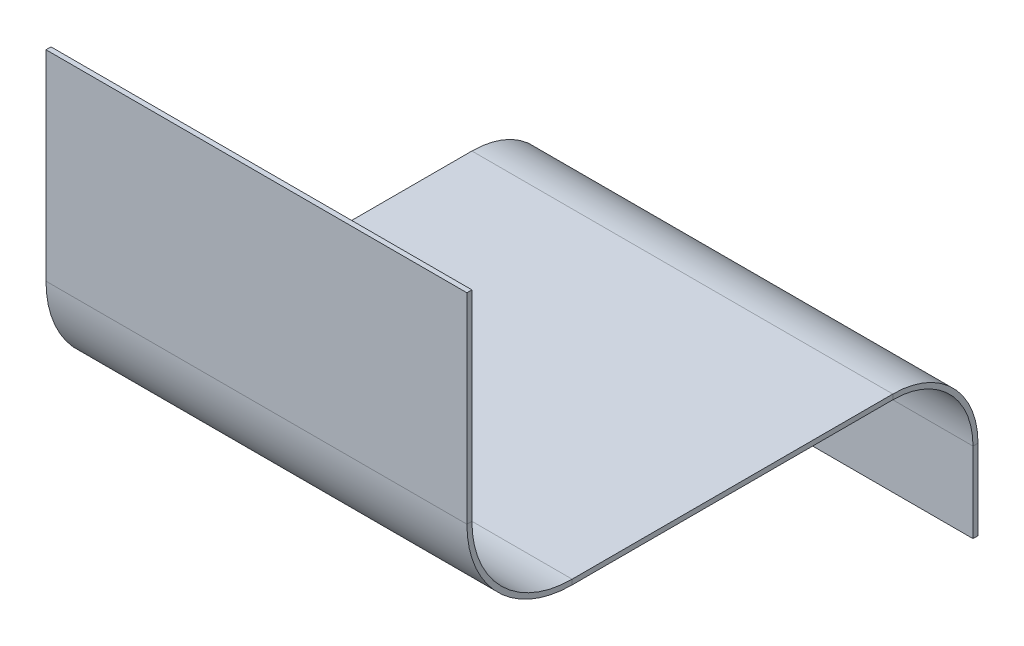
ISO-10303-21;
HEADER;
FILE_DESCRIPTION(('STEP AP214'),'2;1');
FILE_NAME('part.step','',(''),(''),'','','');
FILE_SCHEMA(('AUTOMOTIVE_DESIGN { 1 0 10303 214 1 1 1 1 }'));
ENDSEC;
DATA;
#1=APPLICATION_CONTEXT('core data for automotive mechanical design processes');
#2=APPLICATION_PROTOCOL_DEFINITION('international standard','automotive_design',2000,#1);
#3=PRODUCT_CONTEXT('',#1,'mechanical');
#4=PRODUCT('Part','Part','',(#3));
#5=PRODUCT_RELATED_PRODUCT_CATEGORY('part','',(#4));
#6=PRODUCT_DEFINITION_FORMATION('','',#4);
#7=PRODUCT_DEFINITION_CONTEXT('part definition',#1,'design');
#8=PRODUCT_DEFINITION('design','',#6,#7);
#9=PRODUCT_DEFINITION_SHAPE('','',#8);
#10=(LENGTH_UNIT() NAMED_UNIT(*) SI_UNIT(.MILLI.,.METRE.));
#11=(NAMED_UNIT(*) PLANE_ANGLE_UNIT() SI_UNIT($,.RADIAN.));
#12=(NAMED_UNIT(*) SI_UNIT($,.STERADIAN.) SOLID_ANGLE_UNIT());
#13=UNCERTAINTY_MEASURE_WITH_UNIT(LENGTH_MEASURE(1.E-05),#10,'distance_accuracy_value','');
#14=(GEOMETRIC_REPRESENTATION_CONTEXT(3) GLOBAL_UNCERTAINTY_ASSIGNED_CONTEXT((#13)) GLOBAL_UNIT_ASSIGNED_CONTEXT((#10,
#11,#12)) REPRESENTATION_CONTEXT('',''));
#15=CARTESIAN_POINT('',(0.,0.,0.));
#16=DIRECTION('',(0.,0.,1.));
#17=DIRECTION('',(1.,0.,0.));
#18=AXIS2_PLACEMENT_3D('',#15,#16,#17);
#19=CARTESIAN_POINT('',(21.,8.25,0.));
#20=DIRECTION('',(-1.,0.,0.));
#21=DIRECTION('',(0.,0.,1.));
#22=AXIS2_PLACEMENT_3D('',#19,#20,#21);
#23=PLANE('',#22);
#24=DIRECTION('',(0.,-1.,0.));
#25=VECTOR('',#24,1.);
#26=CARTESIAN_POINT('',(21.,8.25000000000007,20.));
#27=LINE('',#26,#25);
#28=CARTESIAN_POINT('',(21.,8.25000000000007,20.));
#29=VERTEX_POINT('',#28);
#30=CARTESIAN_POINT('',(21.,8.00000000000007,20.));
#31=VERTEX_POINT('',#30);
#32=EDGE_CURVE('E176',#29,#31,#27,.T.);
#33=ORIENTED_EDGE('',*,*,#32,.T.);
#34=DIRECTION('',(0.,0.,-1.));
#35=VECTOR('',#34,1.);
#36=CARTESIAN_POINT('',(21.,8.,0.));
#37=LINE('',#36,#35);
#38=CARTESIAN_POINT('',(21.,8.00000000000001,3.99999999999999));
#39=VERTEX_POINT('',#38);
#40=EDGE_CURVE('E196',#31,#39,#37,.T.);
#41=ORIENTED_EDGE('',*,*,#40,.T.);
#42=DIRECTION('',(0.,1.,0.));
#43=VECTOR('',#42,1.);
#44=CARTESIAN_POINT('',(21.,8.00000000000001,3.99999999999999));
#45=LINE('',#44,#43);
#46=CARTESIAN_POINT('',(21.,8.25000000000001,3.99999999999999));
#47=VERTEX_POINT('',#46);
#48=EDGE_CURVE('E185',#39,#47,#45,.T.);
#49=ORIENTED_EDGE('',*,*,#48,.T.);
#50=DIRECTION('',(0.,0.,-1.));
#51=VECTOR('',#50,1.);
#52=CARTESIAN_POINT('',(21.,8.25,0.));
#53=LINE('',#52,#51);
#54=EDGE_CURVE('E197',#29,#47,#53,.T.);
#55=ORIENTED_EDGE('',*,*,#54,.F.);
#56=EDGE_LOOP('',(#33,#41,#49,#55));
#57=FACE_BOUND('',#56,.T.);
#58=ADVANCED_FACE('F38',(#57),#23,.F.);
#59=CARTESIAN_POINT('',(0.,8.25000000000009,25.));
#60=DIRECTION('',(1.,0.,0.));
#61=DIRECTION('',(0.,0.,-1.));
#62=AXIS2_PLACEMENT_3D('',#59,#60,#61);
#63=PLANE('',#62);
#64=DIRECTION('',(0.,-1.,0.));
#65=VECTOR('',#64,1.);
#66=CARTESIAN_POINT('',(0.,8.25000000000007,20.));
#67=LINE('',#66,#65);
#68=CARTESIAN_POINT('',(0.,8.25000000000007,20.));
#69=VERTEX_POINT('',#68);
#70=CARTESIAN_POINT('',(0.,8.00000000000007,20.));
#71=VERTEX_POINT('',#70);
#72=EDGE_CURVE('E183',#69,#71,#67,.T.);
#73=ORIENTED_EDGE('',*,*,#72,.F.);
#74=DIRECTION('',(0.,0.,1.));
#75=VECTOR('',#74,1.);
#76=CARTESIAN_POINT('',(0.,8.25000000000009,25.));
#77=LINE('',#76,#75);
#78=CARTESIAN_POINT('',(0.,8.25000000000001,3.99999999999999));
#79=VERTEX_POINT('',#78);
#80=EDGE_CURVE('E199',#79,#69,#77,.T.);
#81=ORIENTED_EDGE('',*,*,#80,.F.);
#82=DIRECTION('',(0.,1.,0.));
#83=VECTOR('',#82,1.);
#84=CARTESIAN_POINT('',(0.,8.00000000000001,3.99999999999999));
#85=LINE('',#84,#83);
#86=CARTESIAN_POINT('',(0.,8.00000000000001,3.99999999999999));
#87=VERTEX_POINT('',#86);
#88=EDGE_CURVE('E189',#87,#79,#85,.T.);
#89=ORIENTED_EDGE('',*,*,#88,.F.);
#90=DIRECTION('',(0.,0.,1.));
#91=VECTOR('',#90,1.);
#92=CARTESIAN_POINT('',(0.,8.00000000000009,25.));
#93=LINE('',#92,#91);
#94=EDGE_CURVE('E200',#87,#71,#93,.T.);
#95=ORIENTED_EDGE('',*,*,#94,.T.);
#96=EDGE_LOOP('',(#73,#81,#89,#95));
#97=FACE_BOUND('',#96,.T.);
#98=ADVANCED_FACE('F278',(#97),#63,.F.);
#99=CARTESIAN_POINT('',(0.,8.25,0.));
#100=DIRECTION('',(0.,-1.,0.));
#101=DIRECTION('',(0.,0.,-1.));
#102=AXIS2_PLACEMENT_3D('',#99,#100,#101);
#103=PLANE('',#102);
#104=DIRECTION('',(1.,0.,0.));
#105=VECTOR('',#104,1.);
#106=CARTESIAN_POINT('',(21.,8.25000000000007,20.));
#107=LINE('',#106,#105);
#108=EDGE_CURVE('E180',#29,#69,#107,.F.);
#109=ORIENTED_EDGE('',*,*,#108,.F.);
#110=ORIENTED_EDGE('',*,*,#54,.T.);
#111=DIRECTION('',(1.,0.,0.));
#112=VECTOR('',#111,1.);
#113=CARTESIAN_POINT('',(0.,8.25000000000001,3.99999999999999));
#114=LINE('',#113,#112);
#115=EDGE_CURVE('E192',#79,#47,#114,.T.);
#116=ORIENTED_EDGE('',*,*,#115,.F.);
#117=ORIENTED_EDGE('',*,*,#80,.T.);
#118=EDGE_LOOP('',(#109,#110,#116,#117));
#119=FACE_BOUND('',#118,.T.);
#120=ADVANCED_FACE('F284',(#119),#103,.F.);
#121=CARTESIAN_POINT('',(0.,8.,0.));
#122=DIRECTION('',(0.,-1.,0.));
#123=DIRECTION('',(0.,0.,-1.));
#124=AXIS2_PLACEMENT_3D('',#121,#122,#123);
#125=PLANE('',#124);
#126=ORIENTED_EDGE('',*,*,#40,.F.);
#127=DIRECTION('',(1.,0.,0.));
#128=VECTOR('',#127,1.);
#129=CARTESIAN_POINT('',(21.,8.00000000000007,20.));
#130=LINE('',#129,#128);
#131=EDGE_CURVE('E131',#31,#71,#130,.F.);
#132=ORIENTED_EDGE('',*,*,#131,.T.);
#133=ORIENTED_EDGE('',*,*,#94,.F.);
#134=DIRECTION('',(-1.,0.,0.));
#135=VECTOR('',#134,1.);
#136=CARTESIAN_POINT('',(21.,8.00000000000001,3.99999999999999));
#137=LINE('',#136,#135);
#138=EDGE_CURVE('E187',#39,#87,#137,.T.);
#139=ORIENTED_EDGE('',*,*,#138,.F.);
#140=EDGE_LOOP('',(#126,#132,#133,#139));
#141=FACE_BOUND('',#140,.T.);
#142=ADVANCED_FACE('F363',(#141),#125,.T.);
#143=CARTESIAN_POINT('',(0.,0.,-0.25));
#144=DIRECTION('',(-1.,0.,0.));
#145=DIRECTION('',(0.,-1.,0.));
#146=AXIS2_PLACEMENT_3D('',#143,#144,#145);
#147=PLANE('',#146);
#148=DIRECTION('',(0.,-1.,0.));
#149=VECTOR('',#148,1.);
#150=CARTESIAN_POINT('',(0.,0.,0.));
#151=LINE('',#150,#149);
#152=CARTESIAN_POINT('',(0.,4.00000000000001,0.));
#153=VERTEX_POINT('',#152);
#154=CARTESIAN_POINT('',(0.,0.,0.));
#155=VERTEX_POINT('',#154);
#156=EDGE_CURVE('E224',#153,#155,#151,.T.);
#157=ORIENTED_EDGE('',*,*,#156,.F.);
#158=DIRECTION('',(0.,0.,-1.));
#159=VECTOR('',#158,1.);
#160=CARTESIAN_POINT('',(0.,4.00000000000001,0.));
#161=LINE('',#160,#159);
#162=CARTESIAN_POINT('',(0.,4.00000000000001,-0.25));
#163=VERTEX_POINT('',#162);
#164=EDGE_CURVE('E212',#153,#163,#161,.T.);
#165=ORIENTED_EDGE('',*,*,#164,.T.);
#166=DIRECTION('',(0.,-1.,0.));
#167=VECTOR('',#166,1.);
#168=CARTESIAN_POINT('',(0.,0.,-0.25));
#169=LINE('',#168,#167);
#170=CARTESIAN_POINT('',(0.,0.,-0.25));
#171=VERTEX_POINT('',#170);
#172=EDGE_CURVE('E227',#163,#171,#169,.T.);
#173=ORIENTED_EDGE('',*,*,#172,.T.);
#174=DIRECTION('',(0.,0.,1.));
#175=VECTOR('',#174,1.);
#176=CARTESIAN_POINT('',(0.,0.,-0.25));
#177=LINE('',#176,#175);
#178=EDGE_CURVE('E42',#171,#155,#177,.T.);
#179=ORIENTED_EDGE('',*,*,#178,.T.);
#180=EDGE_LOOP('',(#157,#165,#173,#179));
#181=FACE_BOUND('',#180,.T.);
#182=ADVANCED_FACE('F40',(#181),#147,.T.);
#183=CARTESIAN_POINT('',(0.,0.,-0.25));
#184=DIRECTION('',(0.,0.,-1.));
#185=DIRECTION('',(-1.,0.,0.));
#186=AXIS2_PLACEMENT_3D('',#183,#184,#185);
#187=PLANE('',#186);
#188=ORIENTED_EDGE('',*,*,#172,.F.);
#189=DIRECTION('',(-1.,0.,0.));
#190=VECTOR('',#189,1.);
#191=CARTESIAN_POINT('',(0.,4.00000000000001,-0.25));
#192=LINE('',#191,#190);
#193=CARTESIAN_POINT('',(21.,4.00000000000001,-0.25));
#194=VERTEX_POINT('',#193);
#195=EDGE_CURVE('E207',#163,#194,#192,.F.);
#196=ORIENTED_EDGE('',*,*,#195,.T.);
#197=DIRECTION('',(0.,1.,0.));
#198=VECTOR('',#197,1.);
#199=CARTESIAN_POINT('',(21.,0.,-0.25));
#200=LINE('',#199,#198);
#201=CARTESIAN_POINT('',(21.,0.,-0.25));
#202=VERTEX_POINT('',#201);
#203=EDGE_CURVE('E233',#202,#194,#200,.T.);
#204=ORIENTED_EDGE('',*,*,#203,.F.);
#205=DIRECTION('',(1.,0.,0.));
#206=VECTOR('',#205,1.);
#207=CARTESIAN_POINT('',(0.,0.,-0.25));
#208=LINE('',#207,#206);
#209=EDGE_CURVE('E229',#171,#202,#208,.T.);
#210=ORIENTED_EDGE('',*,*,#209,.F.);
#211=EDGE_LOOP('',(#188,#196,#204,#210));
#212=FACE_BOUND('',#211,.T.);
#213=ADVANCED_FACE('F257',(#212),#187,.T.);
#214=CARTESIAN_POINT('',(0.,0.,0.));
#215=DIRECTION('',(0.,0.,-1.));
#216=DIRECTION('',(-1.,0.,0.));
#217=AXIS2_PLACEMENT_3D('',#214,#215,#216);
#218=PLANE('',#217);
#219=DIRECTION('',(-1.,0.,0.));
#220=VECTOR('',#219,1.);
#221=CARTESIAN_POINT('',(0.,4.00000000000001,0.));
#222=LINE('',#221,#220);
#223=CARTESIAN_POINT('',(21.,4.00000000000001,0.));
#224=VERTEX_POINT('',#223);
#225=EDGE_CURVE('E218',#153,#224,#222,.F.);
#226=ORIENTED_EDGE('',*,*,#225,.F.);
#227=ORIENTED_EDGE('',*,*,#156,.T.);
#228=DIRECTION('',(1.,0.,0.));
#229=VECTOR('',#228,1.);
#230=CARTESIAN_POINT('',(0.,0.,0.));
#231=LINE('',#230,#229);
#232=CARTESIAN_POINT('',(21.,0.,0.));
#233=VERTEX_POINT('',#232);
#234=EDGE_CURVE('E237',#155,#233,#231,.T.);
#235=ORIENTED_EDGE('',*,*,#234,.T.);
#236=DIRECTION('',(0.,1.,0.));
#237=VECTOR('',#236,1.);
#238=CARTESIAN_POINT('',(21.,0.,0.));
#239=LINE('',#238,#237);
#240=EDGE_CURVE('E230',#233,#224,#239,.T.);
#241=ORIENTED_EDGE('',*,*,#240,.T.);
#242=EDGE_LOOP('',(#226,#227,#235,#241));
#243=FACE_BOUND('',#242,.T.);
#244=ADVANCED_FACE('F245',(#243),#218,.F.);
#245=CARTESIAN_POINT('',(21.,0.,-0.25));
#246=DIRECTION('',(1.,0.,0.));
#247=DIRECTION('',(0.,1.,0.));
#248=AXIS2_PLACEMENT_3D('',#245,#246,#247);
#249=PLANE('',#248);
#250=DIRECTION('',(0.,0.,-1.));
#251=VECTOR('',#250,1.);
#252=CARTESIAN_POINT('',(21.,4.00000000000001,0.));
#253=LINE('',#252,#251);
#254=EDGE_CURVE('E222',#224,#194,#253,.T.);
#255=ORIENTED_EDGE('',*,*,#254,.F.);
#256=ORIENTED_EDGE('',*,*,#240,.F.);
#257=DIRECTION('',(0.,0.,1.));
#258=VECTOR('',#257,1.);
#259=CARTESIAN_POINT('',(21.,0.,-0.25));
#260=LINE('',#259,#258);
#261=EDGE_CURVE('E11',#202,#233,#260,.T.);
#262=ORIENTED_EDGE('',*,*,#261,.F.);
#263=ORIENTED_EDGE('',*,*,#203,.T.);
#264=EDGE_LOOP('',(#255,#256,#262,#263));
#265=FACE_BOUND('',#264,.T.);
#266=ADVANCED_FACE('F249',(#265),#249,.T.);
#267=CARTESIAN_POINT('',(0.,0.,-0.25));
#268=DIRECTION('',(0.,-1.,0.));
#269=DIRECTION('',(0.,0.,-1.));
#270=AXIS2_PLACEMENT_3D('',#267,#268,#269);
#271=PLANE('',#270);
#272=ORIENTED_EDGE('',*,*,#234,.F.);
#273=ORIENTED_EDGE('',*,*,#178,.F.);
#274=ORIENTED_EDGE('',*,*,#209,.T.);
#275=ORIENTED_EDGE('',*,*,#261,.T.);
#276=EDGE_LOOP('',(#272,#273,#274,#275));
#277=FACE_BOUND('',#276,.T.);
#278=ADVANCED_FACE('F269',(#277),#271,.T.);
#279=CARTESIAN_POINT('',(21.,4.00000000000001,4.));
#280=DIRECTION('',(1.,0.,0.));
#281=DIRECTION('',(0.,0.,-1.));
#282=AXIS2_PLACEMENT_3D('',#279,#280,#281);
#283=PLANE('',#282);
#284=ORIENTED_EDGE('',*,*,#48,.F.);
#285=CARTESIAN_POINT('',(21.,4.00000000000001,4.));
#286=DIRECTION('',(-1.,0.,0.));
#287=DIRECTION('',(0.,0.,1.));
#288=AXIS2_PLACEMENT_3D('',#285,#286,#287);
#289=CIRCLE('',#288,4.);
#290=EDGE_CURVE('E215',#224,#39,#289,.F.);
#291=ORIENTED_EDGE('',*,*,#290,.F.);
#292=ORIENTED_EDGE('',*,*,#254,.T.);
#293=CARTESIAN_POINT('',(21.,4.00000000000001,4.));
#294=DIRECTION('',(-1.,0.,0.));
#295=DIRECTION('',(0.,0.,1.));
#296=AXIS2_PLACEMENT_3D('',#293,#294,#295);
#297=CIRCLE('',#296,4.25);
#298=EDGE_CURVE('E61',#194,#47,#297,.F.);
#299=ORIENTED_EDGE('',*,*,#298,.T.);
#300=EDGE_LOOP('',(#284,#291,#292,#299));
#301=FACE_BOUND('',#300,.T.);
#302=ADVANCED_FACE('F254',(#301),#283,.T.);
#303=CARTESIAN_POINT('',(0.,4.00000000000001,4.));
#304=DIRECTION('',(1.,0.,0.));
#305=DIRECTION('',(0.,0.,-1.));
#306=AXIS2_PLACEMENT_3D('',#303,#304,#305);
#307=PLANE('',#306);
#308=CARTESIAN_POINT('',(0.,4.00000000000001,4.));
#309=DIRECTION('',(-1.,0.,0.));
#310=DIRECTION('',(0.,0.,1.));
#311=AXIS2_PLACEMENT_3D('',#308,#309,#310);
#312=CIRCLE('',#311,4.);
#313=EDGE_CURVE('E203',#87,#153,#312,.T.);
#314=ORIENTED_EDGE('',*,*,#313,.F.);
#315=ORIENTED_EDGE('',*,*,#88,.T.);
#316=CARTESIAN_POINT('',(0.,4.00000000000001,4.));
#317=DIRECTION('',(-1.,0.,0.));
#318=DIRECTION('',(0.,0.,1.));
#319=AXIS2_PLACEMENT_3D('',#316,#317,#318);
#320=CIRCLE('',#319,4.25);
#321=EDGE_CURVE('E210',#79,#163,#320,.T.);
#322=ORIENTED_EDGE('',*,*,#321,.T.);
#323=ORIENTED_EDGE('',*,*,#164,.F.);
#324=EDGE_LOOP('',(#314,#315,#322,#323));
#325=FACE_BOUND('',#324,.T.);
#326=ADVANCED_FACE('F262',(#325),#307,.F.);
#327=CARTESIAN_POINT('',(0.,4.00000000000001,4.));
#328=DIRECTION('',(-1.,0.,0.));
#329=DIRECTION('',(0.,1.,0.));
#330=AXIS2_PLACEMENT_3D('',#327,#328,#329);
#331=CYLINDRICAL_SURFACE('',#330,4.25);
#332=ORIENTED_EDGE('',*,*,#195,.F.);
#333=ORIENTED_EDGE('',*,*,#321,.F.);
#334=ORIENTED_EDGE('',*,*,#115,.T.);
#335=ORIENTED_EDGE('',*,*,#298,.F.);
#336=EDGE_LOOP('',(#332,#333,#334,#335));
#337=FACE_BOUND('',#336,.T.);
#338=ADVANCED_FACE('F259',(#337),#331,.T.);
#339=CARTESIAN_POINT('',(0.,4.00000000000001,4.));
#340=DIRECTION('',(-1.,0.,0.));
#341=DIRECTION('',(0.,1.,0.));
#342=AXIS2_PLACEMENT_3D('',#339,#340,#341);
#343=CYLINDRICAL_SURFACE('',#342,4.);
#344=ORIENTED_EDGE('',*,*,#225,.T.);
#345=ORIENTED_EDGE('',*,*,#290,.T.);
#346=ORIENTED_EDGE('',*,*,#138,.T.);
#347=ORIENTED_EDGE('',*,*,#313,.T.);
#348=EDGE_LOOP('',(#344,#345,#346,#347));
#349=FACE_BOUND('',#348,.T.);
#350=ADVANCED_FACE('F291',(#349),#343,.F.);
#351=CARTESIAN_POINT('',(0.,13.2500000000001,20.));
#352=DIRECTION('',(-1.,0.,0.));
#353=DIRECTION('',(0.,0.,1.));
#354=AXIS2_PLACEMENT_3D('',#351,#352,#353);
#355=PLANE('',#354);
#356=DIRECTION('',(0.,0.,1.));
#357=VECTOR('',#356,1.);
#358=CARTESIAN_POINT('',(0.,13.2500000000001,25.));
#359=LINE('',#358,#357);
#360=CARTESIAN_POINT('',(0.,13.2500000000001,25.));
#361=VERTEX_POINT('',#360);
#362=CARTESIAN_POINT('',(0.,13.2500000000001,25.25));
#363=VERTEX_POINT('',#362);
#364=EDGE_CURVE('E477',#361,#363,#359,.T.);
#365=ORIENTED_EDGE('',*,*,#364,.F.);
#366=CARTESIAN_POINT('',(0.,13.2500000000001,20.));
#367=DIRECTION('',(1.,0.,0.));
#368=DIRECTION('',(0.,0.,-1.));
#369=AXIS2_PLACEMENT_3D('',#366,#367,#368);
#370=CIRCLE('',#369,5.);
#371=EDGE_CURVE('E134',#69,#361,#370,.F.);
#372=ORIENTED_EDGE('',*,*,#371,.F.);
#373=ORIENTED_EDGE('',*,*,#72,.T.);
#374=CARTESIAN_POINT('',(0.,13.2500000000001,20.));
#375=DIRECTION('',(1.,0.,0.));
#376=DIRECTION('',(0.,0.,-1.));
#377=AXIS2_PLACEMENT_3D('',#374,#375,#376);
#378=CIRCLE('',#377,5.25);
#379=EDGE_CURVE('E53',#71,#363,#378,.F.);
#380=ORIENTED_EDGE('',*,*,#379,.T.);
#381=EDGE_LOOP('',(#365,#372,#373,#380));
#382=FACE_BOUND('',#381,.T.);
#383=ADVANCED_FACE('F293',(#382),#355,.T.);
#384=CARTESIAN_POINT('',(21.,13.2500000000001,20.));
#385=DIRECTION('',(-1.,0.,0.));
#386=DIRECTION('',(0.,0.,1.));
#387=AXIS2_PLACEMENT_3D('',#384,#385,#386);
#388=PLANE('',#387);
#389=CARTESIAN_POINT('',(21.,13.2500000000001,20.));
#390=DIRECTION('',(1.,0.,0.));
#391=DIRECTION('',(0.,0.,-1.));
#392=AXIS2_PLACEMENT_3D('',#389,#390,#391);
#393=CIRCLE('',#392,5.);
#394=CARTESIAN_POINT('',(21.,13.2500000000001,25.));
#395=VERTEX_POINT('',#394);
#396=EDGE_CURVE('E141',#395,#29,#393,.T.);
#397=ORIENTED_EDGE('',*,*,#396,.F.);
#398=DIRECTION('',(0.,0.,1.));
#399=VECTOR('',#398,1.);
#400=CARTESIAN_POINT('',(21.,13.2500000000001,25.));
#401=LINE('',#400,#399);
#402=CARTESIAN_POINT('',(21.,13.2500000000001,25.25));
#403=VERTEX_POINT('',#402);
#404=EDGE_CURVE('E138',#395,#403,#401,.T.);
#405=ORIENTED_EDGE('',*,*,#404,.T.);
#406=CARTESIAN_POINT('',(21.,13.2500000000001,20.));
#407=DIRECTION('',(1.,0.,0.));
#408=DIRECTION('',(0.,0.,-1.));
#409=AXIS2_PLACEMENT_3D('',#406,#407,#408);
#410=CIRCLE('',#409,5.25);
#411=EDGE_CURVE('E125',#403,#31,#410,.T.);
#412=ORIENTED_EDGE('',*,*,#411,.T.);
#413=ORIENTED_EDGE('',*,*,#32,.F.);
#414=EDGE_LOOP('',(#397,#405,#412,#413));
#415=FACE_BOUND('',#414,.T.);
#416=ADVANCED_FACE('F139',(#415),#388,.F.);
#417=CARTESIAN_POINT('',(21.,13.2500000000001,20.));
#418=DIRECTION('',(1.,0.,0.));
#419=DIRECTION('',(0.,0.,1.));
#420=AXIS2_PLACEMENT_3D('',#417,#418,#419);
#421=CYLINDRICAL_SURFACE('',#420,5.25);
#422=ORIENTED_EDGE('',*,*,#131,.F.);
#423=ORIENTED_EDGE('',*,*,#411,.F.);
#424=DIRECTION('',(-1.,0.,0.));
#425=VECTOR('',#424,1.);
#426=CARTESIAN_POINT('',(0.,13.2500000000001,25.25));
#427=LINE('',#426,#425);
#428=EDGE_CURVE('E129',#403,#363,#427,.T.);
#429=ORIENTED_EDGE('',*,*,#428,.T.);
#430=ORIENTED_EDGE('',*,*,#379,.F.);
#431=EDGE_LOOP('',(#422,#423,#429,#430));
#432=FACE_BOUND('',#431,.T.);
#433=ADVANCED_FACE('F127',(#432),#421,.T.);
#434=CARTESIAN_POINT('',(21.,13.2500000000001,20.));
#435=DIRECTION('',(1.,0.,0.));
#436=DIRECTION('',(0.,0.,1.));
#437=AXIS2_PLACEMENT_3D('',#434,#435,#436);
#438=CYLINDRICAL_SURFACE('',#437,5.);
#439=ORIENTED_EDGE('',*,*,#108,.T.);
#440=ORIENTED_EDGE('',*,*,#371,.T.);
#441=DIRECTION('',(1.,0.,0.));
#442=VECTOR('',#441,1.);
#443=CARTESIAN_POINT('',(0.,13.2500000000001,25.));
#444=LINE('',#443,#442);
#445=EDGE_CURVE('E145',#361,#395,#444,.T.);
#446=ORIENTED_EDGE('',*,*,#445,.T.);
#447=ORIENTED_EDGE('',*,*,#396,.T.);
#448=EDGE_LOOP('',(#439,#440,#446,#447));
#449=FACE_BOUND('',#448,.T.);
#450=ADVANCED_FACE('F397',(#449),#438,.F.);
#451=CARTESIAN_POINT('',(0.,8.25000000000009,25.25));
#452=DIRECTION('',(1.,0.,0.));
#453=DIRECTION('',(0.,0.,-1.));
#454=AXIS2_PLACEMENT_3D('',#451,#452,#453);
#455=PLANE('',#454);
#456=ORIENTED_EDGE('',*,*,#364,.T.);
#457=DIRECTION('',(0.,-1.,0.));
#458=VECTOR('',#457,1.);
#459=CARTESIAN_POINT('',(0.,8.25000000000009,25.25));
#460=LINE('',#459,#458);
#461=CARTESIAN_POINT('',(0.,23.2500000000001,25.25));
#462=VERTEX_POINT('',#461);
#463=EDGE_CURVE('E153',#462,#363,#460,.T.);
#464=ORIENTED_EDGE('',*,*,#463,.F.);
#465=DIRECTION('',(0.,0.,-1.));
#466=VECTOR('',#465,1.);
#467=CARTESIAN_POINT('',(0.,23.2500000000001,25.25));
#468=LINE('',#467,#466);
#469=CARTESIAN_POINT('',(0.,23.2500000000001,25.));
#470=VERTEX_POINT('',#469);
#471=EDGE_CURVE('E162',#462,#470,#468,.T.);
#472=ORIENTED_EDGE('',*,*,#471,.T.);
#473=DIRECTION('',(0.,-1.,0.));
#474=VECTOR('',#473,1.);
#475=CARTESIAN_POINT('',(0.,8.25000000000009,25.));
#476=LINE('',#475,#474);
#477=EDGE_CURVE('E154',#470,#361,#476,.T.);
#478=ORIENTED_EDGE('',*,*,#477,.T.);
#479=EDGE_LOOP('',(#456,#464,#472,#478));
#480=FACE_BOUND('',#479,.T.);
#481=ADVANCED_FACE('F407',(#480),#455,.F.);
#482=CARTESIAN_POINT('',(21.,23.2500000000001,25.25));
#483=DIRECTION('',(-1.,0.,0.));
#484=DIRECTION('',(0.,0.,1.));
#485=AXIS2_PLACEMENT_3D('',#482,#483,#484);
#486=PLANE('',#485);
#487=ORIENTED_EDGE('',*,*,#404,.F.);
#488=DIRECTION('',(0.,1.,0.));
#489=VECTOR('',#488,1.);
#490=CARTESIAN_POINT('',(21.,23.2500000000001,25.));
#491=LINE('',#490,#489);
#492=CARTESIAN_POINT('',(21.,23.2500000000001,25.));
#493=VERTEX_POINT('',#492);
#494=EDGE_CURVE('E169',#395,#493,#491,.T.);
#495=ORIENTED_EDGE('',*,*,#494,.T.);
#496=DIRECTION('',(0.,0.,-1.));
#497=VECTOR('',#496,1.);
#498=CARTESIAN_POINT('',(21.,23.2500000000001,25.25));
#499=LINE('',#498,#497);
#500=CARTESIAN_POINT('',(21.,23.2500000000001,25.25));
#501=VERTEX_POINT('',#500);
#502=EDGE_CURVE('E158',#501,#493,#499,.T.);
#503=ORIENTED_EDGE('',*,*,#502,.F.);
#504=DIRECTION('',(0.,1.,0.));
#505=VECTOR('',#504,1.);
#506=CARTESIAN_POINT('',(21.,23.2500000000001,25.25));
#507=LINE('',#506,#505);
#508=EDGE_CURVE('E150',#403,#501,#507,.T.);
#509=ORIENTED_EDGE('',*,*,#508,.F.);
#510=EDGE_LOOP('',(#487,#495,#503,#509));
#511=FACE_BOUND('',#510,.T.);
#512=ADVANCED_FACE('F156',(#511),#486,.F.);
#513=CARTESIAN_POINT('',(0.,0.,25.25));
#514=DIRECTION('',(0.,0.,-1.));
#515=DIRECTION('',(-1.,0.,0.));
#516=AXIS2_PLACEMENT_3D('',#513,#514,#515);
#517=PLANE('',#516);
#518=ORIENTED_EDGE('',*,*,#428,.F.);
#519=ORIENTED_EDGE('',*,*,#508,.T.);
#520=DIRECTION('',(-1.,0.,0.));
#521=VECTOR('',#520,1.);
#522=CARTESIAN_POINT('',(0.,23.2500000000001,25.25));
#523=LINE('',#522,#521);
#524=EDGE_CURVE('E160',#501,#462,#523,.T.);
#525=ORIENTED_EDGE('',*,*,#524,.T.);
#526=ORIENTED_EDGE('',*,*,#463,.T.);
#527=EDGE_LOOP('',(#518,#519,#525,#526));
#528=FACE_BOUND('',#527,.T.);
#529=ADVANCED_FACE('F149',(#528),#517,.F.);
#530=CARTESIAN_POINT('',(0.,0.,25.));
#531=DIRECTION('',(0.,0.,-1.));
#532=DIRECTION('',(-1.,0.,0.));
#533=AXIS2_PLACEMENT_3D('',#530,#531,#532);
#534=PLANE('',#533);
#535=ORIENTED_EDGE('',*,*,#494,.F.);
#536=ORIENTED_EDGE('',*,*,#445,.F.);
#537=ORIENTED_EDGE('',*,*,#477,.F.);
#538=DIRECTION('',(-1.,0.,0.));
#539=VECTOR('',#538,1.);
#540=CARTESIAN_POINT('',(0.,23.2500000000001,25.));
#541=LINE('',#540,#539);
#542=EDGE_CURVE('E164',#493,#470,#541,.T.);
#543=ORIENTED_EDGE('',*,*,#542,.F.);
#544=EDGE_LOOP('',(#535,#536,#537,#543));
#545=FACE_BOUND('',#544,.T.);
#546=ADVANCED_FACE('F437',(#545),#534,.T.);
#547=CARTESIAN_POINT('',(0.,23.2500000000001,25.25));
#548=DIRECTION('',(0.,-1.,0.));
#549=DIRECTION('',(0.,0.,-1.));
#550=AXIS2_PLACEMENT_3D('',#547,#548,#549);
#551=PLANE('',#550);
#552=ORIENTED_EDGE('',*,*,#542,.T.);
#553=ORIENTED_EDGE('',*,*,#471,.F.);
#554=ORIENTED_EDGE('',*,*,#524,.F.);
#555=ORIENTED_EDGE('',*,*,#502,.T.);
#556=EDGE_LOOP('',(#552,#553,#554,#555));
#557=FACE_BOUND('',#556,.T.);
#558=ADVANCED_FACE('F447',(#557),#551,.F.);
#559=CLOSED_SHELL('',(#58,#98,#120,#142,#182,#213,#244,#266,#278,#302,#326,#338,#350,#383,#416,
#433,#450,#481,#512,#529,#546,#558));
#560=MANIFOLD_SOLID_BREP('B2',#559);
#561=ADVANCED_BREP_SHAPE_REPRESENTATION('',(#18,#560),#14);
#562=SHAPE_DEFINITION_REPRESENTATION(#9,#561);
ENDSEC;
END-ISO-10303-21;
